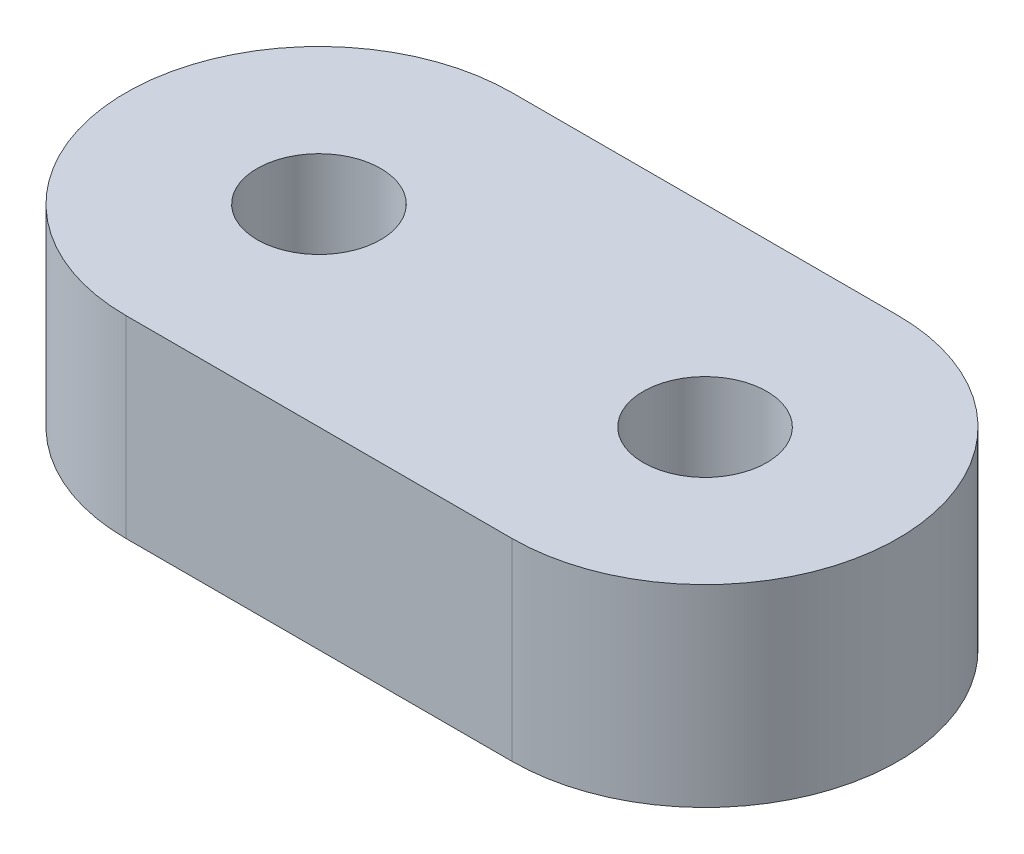
ISO-10303-21;
HEADER;
FILE_DESCRIPTION(('STEP AP214'),'2;1');
FILE_NAME('part.step','',(''),(''),'','','');
FILE_SCHEMA(('AUTOMOTIVE_DESIGN { 1 0 10303 214 1 1 1 1 }'));
ENDSEC;
DATA;
#1=APPLICATION_CONTEXT('core data for automotive mechanical design processes');
#2=APPLICATION_PROTOCOL_DEFINITION('international standard','automotive_design',2000,#1);
#3=PRODUCT_CONTEXT('',#1,'mechanical');
#4=PRODUCT('Part','Part','',(#3));
#5=PRODUCT_RELATED_PRODUCT_CATEGORY('part','',(#4));
#6=PRODUCT_DEFINITION_FORMATION('','',#4);
#7=PRODUCT_DEFINITION_CONTEXT('part definition',#1,'design');
#8=PRODUCT_DEFINITION('design','',#6,#7);
#9=PRODUCT_DEFINITION_SHAPE('','',#8);
#10=(LENGTH_UNIT() NAMED_UNIT(*) SI_UNIT(.MILLI.,.METRE.));
#11=(NAMED_UNIT(*) PLANE_ANGLE_UNIT() SI_UNIT($,.RADIAN.));
#12=(NAMED_UNIT(*) SI_UNIT($,.STERADIAN.) SOLID_ANGLE_UNIT());
#13=UNCERTAINTY_MEASURE_WITH_UNIT(LENGTH_MEASURE(1.E-05),#10,'distance_accuracy_value','');
#14=(GEOMETRIC_REPRESENTATION_CONTEXT(3) GLOBAL_UNCERTAINTY_ASSIGNED_CONTEXT((#13)) GLOBAL_UNIT_ASSIGNED_CONTEXT((#10,
#11,#12)) REPRESENTATION_CONTEXT('',''));
#15=CARTESIAN_POINT('',(0.,0.,0.));
#16=DIRECTION('',(0.,0.,1.));
#17=DIRECTION('',(1.,0.,0.));
#18=AXIS2_PLACEMENT_3D('',#15,#16,#17);
#19=CARTESIAN_POINT('',(5.,2.5,0.));
#20=DIRECTION('',(0.,1.,0.));
#21=DIRECTION('',(0.,0.,1.));
#22=AXIS2_PLACEMENT_3D('',#19,#20,#21);
#23=PLANE('',#22);
#24=CARTESIAN_POINT('',(-5.,2.5,0.));
#25=DIRECTION('',(0.,1.,0.));
#26=DIRECTION('',(0.,0.,1.));
#27=AXIS2_PLACEMENT_3D('',#24,#25,#26);
#28=CIRCLE('',#27,1.6);
#29=CARTESIAN_POINT('',(-5.,2.5,1.6));
#30=VERTEX_POINT('',#29);
#31=EDGE_CURVE('E99',#30,#30,#28,.T.);
#32=ORIENTED_EDGE('',*,*,#31,.F.);
#33=EDGE_LOOP('',(#32));
#34=FACE_BOUND('',#33,.T.);
#35=CARTESIAN_POINT('',(5.,2.5,0.));
#36=DIRECTION('',(0.,1.,0.));
#37=DIRECTION('',(0.,0.,1.));
#38=AXIS2_PLACEMENT_3D('',#35,#36,#37);
#39=CIRCLE('',#38,5.);
#40=CARTESIAN_POINT('',(5.,2.5,5.));
#41=VERTEX_POINT('',#40);
#42=CARTESIAN_POINT('',(5.,2.5,-5.));
#43=VERTEX_POINT('',#42);
#44=EDGE_CURVE('E84',#41,#43,#39,.T.);
#45=ORIENTED_EDGE('',*,*,#44,.T.);
#46=DIRECTION('',(-1.,0.,0.));
#47=VECTOR('',#46,1.);
#48=CARTESIAN_POINT('',(5.,2.5,-5.));
#49=LINE('',#48,#47);
#50=CARTESIAN_POINT('',(-5.,2.5,-5.));
#51=VERTEX_POINT('',#50);
#52=EDGE_CURVE('E79',#43,#51,#49,.T.);
#53=ORIENTED_EDGE('',*,*,#52,.T.);
#54=CARTESIAN_POINT('',(-5.,2.5,0.));
#55=DIRECTION('',(0.,1.,0.));
#56=DIRECTION('',(0.,0.,1.));
#57=AXIS2_PLACEMENT_3D('',#54,#55,#56);
#58=CIRCLE('',#57,5.);
#59=CARTESIAN_POINT('',(-5.,2.5,5.));
#60=VERTEX_POINT('',#59);
#61=EDGE_CURVE('E82',#51,#60,#58,.T.);
#62=ORIENTED_EDGE('',*,*,#61,.T.);
#63=DIRECTION('',(1.,0.,0.));
#64=VECTOR('',#63,1.);
#65=CARTESIAN_POINT('',(5.,2.5,5.));
#66=LINE('',#65,#64);
#67=EDGE_CURVE('E49',#60,#41,#66,.T.);
#68=ORIENTED_EDGE('',*,*,#67,.T.);
#69=EDGE_LOOP('',(#45,#53,#62,#68));
#70=FACE_BOUND('',#69,.T.);
#71=CARTESIAN_POINT('',(5.,2.5,0.));
#72=DIRECTION('',(0.,1.,0.));
#73=DIRECTION('',(0.,0.,1.));
#74=AXIS2_PLACEMENT_3D('',#71,#72,#73);
#75=CIRCLE('',#74,1.6);
#76=CARTESIAN_POINT('',(5.,2.5,1.6));
#77=VERTEX_POINT('',#76);
#78=EDGE_CURVE('E114',#77,#77,#75,.T.);
#79=ORIENTED_EDGE('',*,*,#78,.F.);
#80=EDGE_LOOP('',(#79));
#81=FACE_BOUND('',#80,.T.);
#82=ADVANCED_FACE('F32',(#34,#70,#81),#23,.T.);
#83=CARTESIAN_POINT('',(5.,-2.5,0.));
#84=DIRECTION('',(0.,1.,0.));
#85=DIRECTION('',(0.,0.,1.));
#86=AXIS2_PLACEMENT_3D('',#83,#84,#85);
#87=PLANE('',#86);
#88=CARTESIAN_POINT('',(5.,-2.5,0.));
#89=DIRECTION('',(0.,1.,0.));
#90=DIRECTION('',(0.,0.,1.));
#91=AXIS2_PLACEMENT_3D('',#88,#89,#90);
#92=CIRCLE('',#91,5.);
#93=CARTESIAN_POINT('',(5.,-2.5,5.));
#94=VERTEX_POINT('',#93);
#95=CARTESIAN_POINT('',(5.,-2.5,-5.));
#96=VERTEX_POINT('',#95);
#97=EDGE_CURVE('E96',#94,#96,#92,.T.);
#98=ORIENTED_EDGE('',*,*,#97,.F.);
#99=DIRECTION('',(1.,0.,0.));
#100=VECTOR('',#99,1.);
#101=CARTESIAN_POINT('',(5.,-2.5,5.));
#102=LINE('',#101,#100);
#103=CARTESIAN_POINT('',(-5.,-2.5,5.));
#104=VERTEX_POINT('',#103);
#105=EDGE_CURVE('E72',#104,#94,#102,.T.);
#106=ORIENTED_EDGE('',*,*,#105,.F.);
#107=CARTESIAN_POINT('',(-5.,-2.5,0.));
#108=DIRECTION('',(0.,1.,0.));
#109=DIRECTION('',(0.,0.,1.));
#110=AXIS2_PLACEMENT_3D('',#107,#108,#109);
#111=CIRCLE('',#110,5.);
#112=CARTESIAN_POINT('',(-5.,-2.5,-5.));
#113=VERTEX_POINT('',#112);
#114=EDGE_CURVE('E66',#113,#104,#111,.T.);
#115=ORIENTED_EDGE('',*,*,#114,.F.);
#116=DIRECTION('',(-1.,0.,0.));
#117=VECTOR('',#116,1.);
#118=CARTESIAN_POINT('',(5.,-2.5,-5.));
#119=LINE('',#118,#117);
#120=EDGE_CURVE('E88',#96,#113,#119,.T.);
#121=ORIENTED_EDGE('',*,*,#120,.F.);
#122=EDGE_LOOP('',(#98,#106,#115,#121));
#123=FACE_BOUND('',#122,.T.);
#124=CARTESIAN_POINT('',(-5.,-2.5,0.));
#125=DIRECTION('',(0.,1.,0.));
#126=DIRECTION('',(0.,0.,1.));
#127=AXIS2_PLACEMENT_3D('',#124,#125,#126);
#128=CIRCLE('',#127,1.6);
#129=CARTESIAN_POINT('',(-5.,-2.5,1.6));
#130=VERTEX_POINT('',#129);
#131=EDGE_CURVE('E111',#130,#130,#128,.T.);
#132=ORIENTED_EDGE('',*,*,#131,.T.);
#133=EDGE_LOOP('',(#132));
#134=FACE_BOUND('',#133,.T.);
#135=CARTESIAN_POINT('',(5.,-2.5,0.));
#136=DIRECTION('',(0.,1.,0.));
#137=DIRECTION('',(0.,0.,1.));
#138=AXIS2_PLACEMENT_3D('',#135,#136,#137);
#139=CIRCLE('',#138,1.6);
#140=CARTESIAN_POINT('',(5.,-2.5,1.6));
#141=VERTEX_POINT('',#140);
#142=EDGE_CURVE('E117',#141,#141,#139,.T.);
#143=ORIENTED_EDGE('',*,*,#142,.T.);
#144=EDGE_LOOP('',(#143));
#145=FACE_BOUND('',#144,.T.);
#146=ADVANCED_FACE('F107',(#123,#134,#145),#87,.F.);
#147=CARTESIAN_POINT('',(5.,2.5,0.));
#148=DIRECTION('',(0.,-1.,0.));
#149=DIRECTION('',(0.,0.,-1.));
#150=AXIS2_PLACEMENT_3D('',#147,#148,#149);
#151=CYLINDRICAL_SURFACE('',#150,5.);
#152=ORIENTED_EDGE('',*,*,#97,.T.);
#153=DIRECTION('',(0.,-1.,0.));
#154=VECTOR('',#153,1.);
#155=CARTESIAN_POINT('',(5.,2.5,-5.));
#156=LINE('',#155,#154);
#157=EDGE_CURVE('E11',#43,#96,#156,.T.);
#158=ORIENTED_EDGE('',*,*,#157,.F.);
#159=ORIENTED_EDGE('',*,*,#44,.F.);
#160=DIRECTION('',(0.,-1.,0.));
#161=VECTOR('',#160,1.);
#162=CARTESIAN_POINT('',(5.,2.5,5.));
#163=LINE('',#162,#161);
#164=EDGE_CURVE('E92',#41,#94,#163,.T.);
#165=ORIENTED_EDGE('',*,*,#164,.T.);
#166=EDGE_LOOP('',(#152,#158,#159,#165));
#167=FACE_BOUND('',#166,.T.);
#168=ADVANCED_FACE('F34',(#167),#151,.T.);
#169=CARTESIAN_POINT('',(5.,2.5,-5.));
#170=DIRECTION('',(0.,0.,1.));
#171=DIRECTION('',(1.,0.,0.));
#172=AXIS2_PLACEMENT_3D('',#169,#170,#171);
#173=PLANE('',#172);
#174=ORIENTED_EDGE('',*,*,#120,.T.);
#175=DIRECTION('',(0.,-1.,0.));
#176=VECTOR('',#175,1.);
#177=CARTESIAN_POINT('',(-5.,2.5,-5.));
#178=LINE('',#177,#176);
#179=EDGE_CURVE('E41',#51,#113,#178,.T.);
#180=ORIENTED_EDGE('',*,*,#179,.F.);
#181=ORIENTED_EDGE('',*,*,#52,.F.);
#182=ORIENTED_EDGE('',*,*,#157,.T.);
#183=EDGE_LOOP('',(#174,#180,#181,#182));
#184=FACE_BOUND('',#183,.T.);
#185=ADVANCED_FACE('F87',(#184),#173,.F.);
#186=CARTESIAN_POINT('',(-5.,2.5,0.));
#187=DIRECTION('',(0.,-1.,0.));
#188=DIRECTION('',(0.,0.,-1.));
#189=AXIS2_PLACEMENT_3D('',#186,#187,#188);
#190=CYLINDRICAL_SURFACE('',#189,5.);
#191=ORIENTED_EDGE('',*,*,#114,.T.);
#192=DIRECTION('',(0.,-1.,0.));
#193=VECTOR('',#192,1.);
#194=CARTESIAN_POINT('',(-5.,2.5,5.));
#195=LINE('',#194,#193);
#196=EDGE_CURVE('E89',#60,#104,#195,.T.);
#197=ORIENTED_EDGE('',*,*,#196,.F.);
#198=ORIENTED_EDGE('',*,*,#61,.F.);
#199=ORIENTED_EDGE('',*,*,#179,.T.);
#200=EDGE_LOOP('',(#191,#197,#198,#199));
#201=FACE_BOUND('',#200,.T.);
#202=ADVANCED_FACE('F90',(#201),#190,.T.);
#203=CARTESIAN_POINT('',(5.,2.5,5.));
#204=DIRECTION('',(0.,0.,-1.));
#205=DIRECTION('',(-1.,0.,0.));
#206=AXIS2_PLACEMENT_3D('',#203,#204,#205);
#207=PLANE('',#206);
#208=ORIENTED_EDGE('',*,*,#105,.T.);
#209=ORIENTED_EDGE('',*,*,#164,.F.);
#210=ORIENTED_EDGE('',*,*,#67,.F.);
#211=ORIENTED_EDGE('',*,*,#196,.T.);
#212=EDGE_LOOP('',(#208,#209,#210,#211));
#213=FACE_BOUND('',#212,.T.);
#214=ADVANCED_FACE('F104',(#213),#207,.F.);
#215=CARTESIAN_POINT('',(-5.,2.5,0.));
#216=DIRECTION('',(0.,-1.,0.));
#217=DIRECTION('',(0.,0.,-1.));
#218=AXIS2_PLACEMENT_3D('',#215,#216,#217);
#219=CYLINDRICAL_SURFACE('',#218,1.6);
#220=ORIENTED_EDGE('',*,*,#31,.T.);
#221=EDGE_LOOP('',(#220));
#222=FACE_BOUND('',#221,.T.);
#223=ORIENTED_EDGE('',*,*,#131,.F.);
#224=EDGE_LOOP('',(#223));
#225=FACE_BOUND('',#224,.T.);
#226=ADVANCED_FACE('F134',(#222,#225),#219,.F.);
#227=CARTESIAN_POINT('',(5.,2.5,0.));
#228=DIRECTION('',(0.,-1.,0.));
#229=DIRECTION('',(0.,0.,-1.));
#230=AXIS2_PLACEMENT_3D('',#227,#228,#229);
#231=CYLINDRICAL_SURFACE('',#230,1.6);
#232=ORIENTED_EDGE('',*,*,#78,.T.);
#233=EDGE_LOOP('',(#232));
#234=FACE_BOUND('',#233,.T.);
#235=ORIENTED_EDGE('',*,*,#142,.F.);
#236=EDGE_LOOP('',(#235));
#237=FACE_BOUND('',#236,.T.);
#238=ADVANCED_FACE('F123',(#234,#237),#231,.F.);
#239=CLOSED_SHELL('',(#82,#146,#168,#185,#202,#214,#226,#238));
#240=MANIFOLD_SOLID_BREP('B2',#239);
#241=ADVANCED_BREP_SHAPE_REPRESENTATION('',(#18,#240),#14);
#242=SHAPE_DEFINITION_REPRESENTATION(#9,#241);
ENDSEC;
END-ISO-10303-21;
